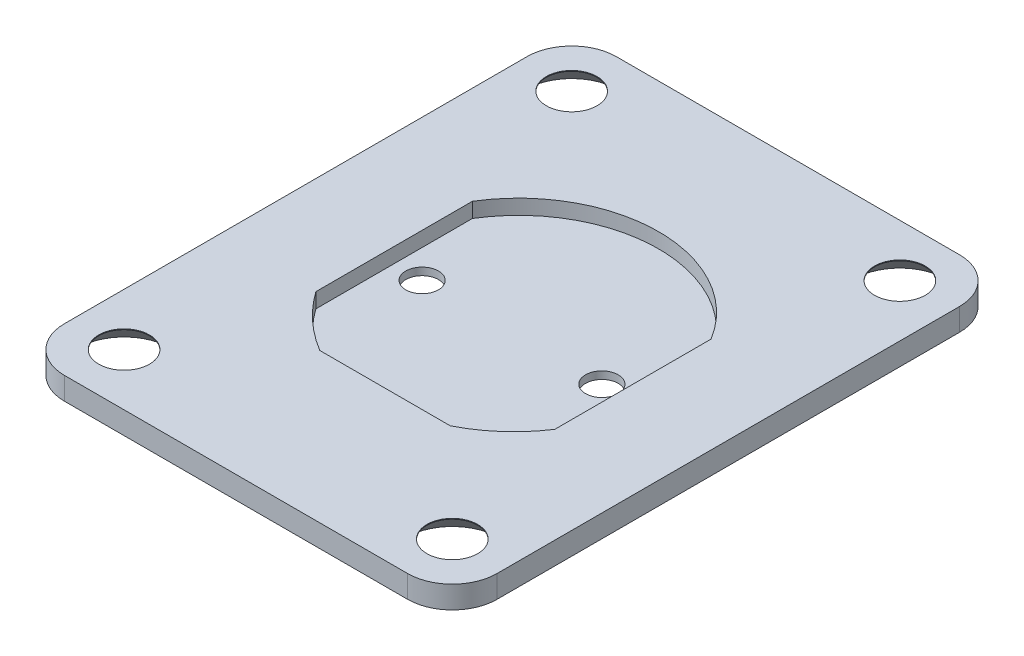
ISO-10303-21;
HEADER;
FILE_DESCRIPTION(('STEP AP214'),'2;1');
FILE_NAME('part.step','',(''),(''),'','','');
FILE_SCHEMA(('AUTOMOTIVE_DESIGN { 1 0 10303 214 1 1 1 1 }'));
ENDSEC;
DATA;
#1=APPLICATION_CONTEXT('core data for automotive mechanical design processes');
#2=APPLICATION_PROTOCOL_DEFINITION('international standard','automotive_design',2000,#1);
#3=PRODUCT_CONTEXT('',#1,'mechanical');
#4=PRODUCT('Part','Part','',(#3));
#5=PRODUCT_RELATED_PRODUCT_CATEGORY('part','',(#4));
#6=PRODUCT_DEFINITION_FORMATION('','',#4);
#7=PRODUCT_DEFINITION_CONTEXT('part definition',#1,'design');
#8=PRODUCT_DEFINITION('design','',#6,#7);
#9=PRODUCT_DEFINITION_SHAPE('','',#8);
#10=(LENGTH_UNIT() NAMED_UNIT(*) SI_UNIT(.MILLI.,.METRE.));
#11=(NAMED_UNIT(*) PLANE_ANGLE_UNIT() SI_UNIT($,.RADIAN.));
#12=(NAMED_UNIT(*) SI_UNIT($,.STERADIAN.) SOLID_ANGLE_UNIT());
#13=UNCERTAINTY_MEASURE_WITH_UNIT(LENGTH_MEASURE(1.E-05),#10,'distance_accuracy_value','');
#14=(GEOMETRIC_REPRESENTATION_CONTEXT(3) GLOBAL_UNCERTAINTY_ASSIGNED_CONTEXT((#13)) GLOBAL_UNIT_ASSIGNED_CONTEXT((#10,
#11,#12)) REPRESENTATION_CONTEXT('',''));
#15=CARTESIAN_POINT('',(0.,0.,0.));
#16=DIRECTION('',(0.,0.,1.));
#17=DIRECTION('',(1.,0.,0.));
#18=AXIS2_PLACEMENT_3D('',#15,#16,#17);
#19=CARTESIAN_POINT('',(0.,0.,0.));
#20=DIRECTION('',(0.,1.,0.));
#21=DIRECTION('',(0.,0.,1.));
#22=AXIS2_PLACEMENT_3D('',#19,#20,#21);
#23=PLANE('',#22);
#24=CARTESIAN_POINT('',(-11.,0.,15.));
#25=DIRECTION('',(0.,-1.,0.));
#26=DIRECTION('',(0.,0.,-1.));
#27=AXIS2_PLACEMENT_3D('',#24,#25,#26);
#28=CIRCLE('',#27,3.15);
#29=CARTESIAN_POINT('',(-11.,0.,11.85));
#30=VERTEX_POINT('',#29);
#31=EDGE_CURVE('E635',#30,#30,#28,.T.);
#32=ORIENTED_EDGE('',*,*,#31,.F.);
#33=EDGE_LOOP('',(#32));
#34=FACE_BOUND('',#33,.T.);
#35=CARTESIAN_POINT('',(-6.025,0.,0.));
#36=DIRECTION('',(0.,1.,0.));
#37=DIRECTION('',(0.,0.,1.));
#38=AXIS2_PLACEMENT_3D('',#35,#36,#37);
#39=CIRCLE('',#38,1.095);
#40=CARTESIAN_POINT('',(-6.025,0.,1.095));
#41=VERTEX_POINT('',#40);
#42=EDGE_CURVE('E238',#41,#41,#39,.T.);
#43=ORIENTED_EDGE('',*,*,#42,.T.);
#44=EDGE_LOOP('',(#43));
#45=FACE_BOUND('',#44,.T.);
#46=CARTESIAN_POINT('',(6.025,0.,0.));
#47=DIRECTION('',(0.,1.,0.));
#48=DIRECTION('',(0.,0.,1.));
#49=AXIS2_PLACEMENT_3D('',#46,#47,#48);
#50=CIRCLE('',#49,1.095);
#51=CARTESIAN_POINT('',(6.025,0.,1.095));
#52=VERTEX_POINT('',#51);
#53=EDGE_CURVE('E156',#52,#52,#50,.T.);
#54=ORIENTED_EDGE('',*,*,#53,.T.);
#55=EDGE_LOOP('',(#54));
#56=FACE_BOUND('',#55,.T.);
#57=DIRECTION('',(0.,0.,1.));
#58=VECTOR('',#57,1.);
#59=CARTESIAN_POINT('',(-14.5,0.,18.5));
#60=LINE('',#59,#58);
#61=CARTESIAN_POINT('',(-14.5,0.,-15.5));
#62=VERTEX_POINT('',#61);
#63=CARTESIAN_POINT('',(-14.5,0.,15.5));
#64=VERTEX_POINT('',#63);
#65=EDGE_CURVE('E253',#62,#64,#60,.T.);
#66=ORIENTED_EDGE('',*,*,#65,.F.);
#67=CARTESIAN_POINT('',(-11.5,0.,-15.5));
#68=DIRECTION('',(0.,1.,0.));
#69=DIRECTION('',(0.,0.,1.));
#70=AXIS2_PLACEMENT_3D('',#67,#68,#69);
#71=CIRCLE('',#70,3.);
#72=CARTESIAN_POINT('',(-11.5,0.,-18.5));
#73=VERTEX_POINT('',#72);
#74=EDGE_CURVE('E284',#62,#73,#71,.F.);
#75=ORIENTED_EDGE('',*,*,#74,.T.);
#76=DIRECTION('',(-1.,0.,0.));
#77=VECTOR('',#76,1.);
#78=CARTESIAN_POINT('',(14.5,0.,-18.5));
#79=LINE('',#78,#77);
#80=CARTESIAN_POINT('',(11.5,0.,-18.5));
#81=VERTEX_POINT('',#80);
#82=EDGE_CURVE('E264',#81,#73,#79,.T.);
#83=ORIENTED_EDGE('',*,*,#82,.F.);
#84=CARTESIAN_POINT('',(11.5,0.,-15.5));
#85=DIRECTION('',(0.,1.,0.));
#86=DIRECTION('',(0.,0.,1.));
#87=AXIS2_PLACEMENT_3D('',#84,#85,#86);
#88=CIRCLE('',#87,3.);
#89=CARTESIAN_POINT('',(14.5,0.,-15.5));
#90=VERTEX_POINT('',#89);
#91=EDGE_CURVE('E281',#81,#90,#88,.F.);
#92=ORIENTED_EDGE('',*,*,#91,.T.);
#93=DIRECTION('',(0.,0.,-1.));
#94=VECTOR('',#93,1.);
#95=CARTESIAN_POINT('',(14.5,0.,18.5));
#96=LINE('',#95,#94);
#97=CARTESIAN_POINT('',(14.5,0.,15.5));
#98=VERTEX_POINT('',#97);
#99=EDGE_CURVE('E261',#98,#90,#96,.T.);
#100=ORIENTED_EDGE('',*,*,#99,.F.);
#101=CARTESIAN_POINT('',(11.5,0.,15.5));
#102=DIRECTION('',(0.,1.,0.));
#103=DIRECTION('',(0.,0.,1.));
#104=AXIS2_PLACEMENT_3D('',#101,#102,#103);
#105=CIRCLE('',#104,3.);
#106=CARTESIAN_POINT('',(11.5,0.,18.5));
#107=VERTEX_POINT('',#106);
#108=EDGE_CURVE('E275',#98,#107,#105,.F.);
#109=ORIENTED_EDGE('',*,*,#108,.T.);
#110=DIRECTION('',(1.,0.,0.));
#111=VECTOR('',#110,1.);
#112=CARTESIAN_POINT('',(14.5,0.,18.5));
#113=LINE('',#112,#111);
#114=CARTESIAN_POINT('',(-11.5,0.,18.5));
#115=VERTEX_POINT('',#114);
#116=EDGE_CURVE('E257',#115,#107,#113,.T.);
#117=ORIENTED_EDGE('',*,*,#116,.F.);
#118=CARTESIAN_POINT('',(-11.5,0.,15.5));
#119=DIRECTION('',(0.,1.,0.));
#120=DIRECTION('',(0.,0.,1.));
#121=AXIS2_PLACEMENT_3D('',#118,#119,#120);
#122=CIRCLE('',#121,3.);
#123=EDGE_CURVE('E278',#115,#64,#122,.F.);
#124=ORIENTED_EDGE('',*,*,#123,.T.);
#125=EDGE_LOOP('',(#66,#75,#83,#92,#100,#109,#117,#124));
#126=FACE_BOUND('',#125,.T.);
#127=CARTESIAN_POINT('',(11.,0.,15.));
#128=DIRECTION('',(0.,-1.,0.));
#129=DIRECTION('',(0.,0.,-1.));
#130=AXIS2_PLACEMENT_3D('',#127,#128,#129);
#131=CIRCLE('',#130,3.15);
#132=CARTESIAN_POINT('',(11.,0.,11.85));
#133=VERTEX_POINT('',#132);
#134=EDGE_CURVE('E623',#133,#133,#131,.T.);
#135=ORIENTED_EDGE('',*,*,#134,.F.);
#136=EDGE_LOOP('',(#135));
#137=FACE_BOUND('',#136,.T.);
#138=CARTESIAN_POINT('',(11.,0.,-15.));
#139=DIRECTION('',(0.,-1.,0.));
#140=DIRECTION('',(0.,0.,-1.));
#141=AXIS2_PLACEMENT_3D('',#138,#139,#140);
#142=CIRCLE('',#141,3.15);
#143=CARTESIAN_POINT('',(11.,0.,-18.15));
#144=VERTEX_POINT('',#143);
#145=EDGE_CURVE('E611',#144,#144,#142,.T.);
#146=ORIENTED_EDGE('',*,*,#145,.F.);
#147=EDGE_LOOP('',(#146));
#148=FACE_BOUND('',#147,.T.);
#149=CARTESIAN_POINT('',(-11.,0.,-15.));
#150=DIRECTION('',(0.,-1.,0.));
#151=DIRECTION('',(0.,0.,-1.));
#152=AXIS2_PLACEMENT_3D('',#149,#150,#151);
#153=CIRCLE('',#152,3.15);
#154=CARTESIAN_POINT('',(-11.,0.,-18.15));
#155=VERTEX_POINT('',#154);
#156=EDGE_CURVE('E600',#155,#155,#153,.T.);
#157=ORIENTED_EDGE('',*,*,#156,.F.);
#158=EDGE_LOOP('',(#157));
#159=FACE_BOUND('',#158,.T.);
#160=ADVANCED_FACE('F40',(#34,#45,#56,#126,#137,#148,#159),#23,.F.);
#161=CARTESIAN_POINT('',(0.,0.5,0.));
#162=DIRECTION('',(0.,1.,0.));
#163=DIRECTION('',(0.,0.,1.));
#164=AXIS2_PLACEMENT_3D('',#161,#162,#163);
#165=PLANE('',#164);
#166=CARTESIAN_POINT('',(6.025,0.5,0.));
#167=DIRECTION('',(0.,1.,0.));
#168=DIRECTION('',(0.,0.,1.));
#169=AXIS2_PLACEMENT_3D('',#166,#167,#168);
#170=CIRCLE('',#169,1.095);
#171=CARTESIAN_POINT('',(6.025,0.5,1.095));
#172=VERTEX_POINT('',#171);
#173=EDGE_CURVE('E242',#172,#172,#170,.T.);
#174=ORIENTED_EDGE('',*,*,#173,.F.);
#175=EDGE_LOOP('',(#174));
#176=FACE_BOUND('',#175,.T.);
#177=CARTESIAN_POINT('',(-6.025,0.5,0.));
#178=DIRECTION('',(0.,1.,0.));
#179=DIRECTION('',(0.,0.,1.));
#180=AXIS2_PLACEMENT_3D('',#177,#178,#179);
#181=CIRCLE('',#180,1.095);
#182=CARTESIAN_POINT('',(-6.025,0.5,1.095));
#183=VERTEX_POINT('',#182);
#184=EDGE_CURVE('E249',#183,#183,#181,.T.);
#185=ORIENTED_EDGE('',*,*,#184,.F.);
#186=EDGE_LOOP('',(#185));
#187=FACE_BOUND('',#186,.T.);
#188=DIRECTION('',(-1.,0.,0.));
#189=VECTOR('',#188,1.);
#190=CARTESIAN_POINT('',(0.,0.5,8.49646857911351));
#191=LINE('',#190,#189);
#192=CARTESIAN_POINT('',(4.36293573535211,0.5,8.49646857911351));
#193=VERTEX_POINT('',#192);
#194=CARTESIAN_POINT('',(-4.38535437381607,0.5,8.49646857911351));
#195=VERTEX_POINT('',#194);
#196=EDGE_CURVE('E209',#193,#195,#191,.T.);
#197=ORIENTED_EDGE('',*,*,#196,.F.);
#198=CARTESIAN_POINT('',(0.0516392629655443,0.5,-0.0770388782704128));
#199=DIRECTION('',(0.,1.,0.));
#200=DIRECTION('',(0.,0.,1.));
#201=AXIS2_PLACEMENT_3D('',#198,#199,#200);
#202=CIRCLE('',#201,9.5964736958234);
#203=CARTESIAN_POINT('',(8.06575283771195,0.5,5.20181431212008));
#204=VERTEX_POINT('',#203);
#205=EDGE_CURVE('E152',#193,#204,#202,.T.);
#206=ORIENTED_EDGE('',*,*,#205,.T.);
#207=DIRECTION('',(0.,0.,-1.));
#208=VECTOR('',#207,1.);
#209=CARTESIAN_POINT('',(8.06575283771195,0.5,0.));
#210=LINE('',#209,#208);
#211=CARTESIAN_POINT('',(8.06575283771195,0.5,-5.28085689571229));
#212=VERTEX_POINT('',#211);
#213=EDGE_CURVE('E173',#204,#212,#210,.T.);
#214=ORIENTED_EDGE('',*,*,#213,.T.);
#215=CARTESIAN_POINT('',(0.065752837711952,0.5,-0.373244663344949));
#216=DIRECTION('',(0.,1.,0.));
#217=DIRECTION('',(0.,0.,1.));
#218=AXIS2_PLACEMENT_3D('',#215,#216,#217);
#219=CIRCLE('',#218,9.38534271208471);
#220=CARTESIAN_POINT('',(-7.93424716228805,0.5,-5.28085689571229));
#221=VERTEX_POINT('',#220);
#222=EDGE_CURVE('E176',#221,#212,#219,.F.);
#223=ORIENTED_EDGE('',*,*,#222,.F.);
#224=DIRECTION('',(0.,0.,-1.));
#225=VECTOR('',#224,1.);
#226=CARTESIAN_POINT('',(-7.93424716228805,0.5,0.));
#227=LINE('',#226,#225);
#228=CARTESIAN_POINT('',(-7.93424716228805,0.5,5.21151209766785));
#229=VERTEX_POINT('',#228);
#230=EDGE_CURVE('E215',#229,#221,#227,.T.);
#231=ORIENTED_EDGE('',*,*,#230,.F.);
#232=CARTESIAN_POINT('',(1.73650070340641,0.5,-1.67675504771776));
#233=DIRECTION('',(0.,1.,0.));
#234=DIRECTION('',(0.,0.,1.));
#235=AXIS2_PLACEMENT_3D('',#232,#233,#234);
#236=CIRCLE('',#235,11.8731456888237);
#237=EDGE_CURVE('E212',#229,#195,#236,.T.);
#238=ORIENTED_EDGE('',*,*,#237,.T.);
#239=EDGE_LOOP('',(#197,#206,#214,#223,#231,#238));
#240=FACE_BOUND('',#239,.T.);
#241=ADVANCED_FACE('F352',(#176,#187,#240),#165,.T.);
#242=CARTESIAN_POINT('',(-14.5,0.5,18.5));
#243=DIRECTION('',(1.,0.,0.));
#244=DIRECTION('',(0.,0.,-1.));
#245=AXIS2_PLACEMENT_3D('',#242,#243,#244);
#246=PLANE('',#245);
#247=DIRECTION('',(0.,0.,1.));
#248=VECTOR('',#247,1.);
#249=CARTESIAN_POINT('',(-14.5,1.5,0.));
#250=LINE('',#249,#248);
#251=CARTESIAN_POINT('',(-14.5,1.5,-15.5));
#252=VERTEX_POINT('',#251);
#253=CARTESIAN_POINT('',(-14.5,1.5,15.5));
#254=VERTEX_POINT('',#253);
#255=EDGE_CURVE('E196',#252,#254,#250,.T.);
#256=ORIENTED_EDGE('',*,*,#255,.F.);
#257=DIRECTION('',(0.,-1.,0.));
#258=VECTOR('',#257,1.);
#259=CARTESIAN_POINT('',(-14.5,0.5,-15.5));
#260=LINE('',#259,#258);
#261=EDGE_CURVE('E271',#252,#62,#260,.T.);
#262=ORIENTED_EDGE('',*,*,#261,.T.);
#263=ORIENTED_EDGE('',*,*,#65,.T.);
#264=DIRECTION('',(0.,-1.,0.));
#265=VECTOR('',#264,1.);
#266=CARTESIAN_POINT('',(-14.5,0.5,15.5));
#267=LINE('',#266,#265);
#268=EDGE_CURVE('E268',#64,#254,#267,.F.);
#269=ORIENTED_EDGE('',*,*,#268,.T.);
#270=EDGE_LOOP('',(#256,#262,#263,#269));
#271=FACE_BOUND('',#270,.T.);
#272=ADVANCED_FACE('F340',(#271),#246,.F.);
#273=CARTESIAN_POINT('',(14.5,0.5,18.5));
#274=DIRECTION('',(0.,0.,-1.));
#275=DIRECTION('',(-1.,0.,0.));
#276=AXIS2_PLACEMENT_3D('',#273,#274,#275);
#277=PLANE('',#276);
#278=DIRECTION('',(1.,0.,0.));
#279=VECTOR('',#278,1.);
#280=CARTESIAN_POINT('',(0.,1.5,18.5));
#281=LINE('',#280,#279);
#282=CARTESIAN_POINT('',(-11.5,1.5,18.5));
#283=VERTEX_POINT('',#282);
#284=CARTESIAN_POINT('',(11.5,1.5,18.5));
#285=VERTEX_POINT('',#284);
#286=EDGE_CURVE('E200',#283,#285,#281,.T.);
#287=ORIENTED_EDGE('',*,*,#286,.F.);
#288=DIRECTION('',(0.,-1.,0.));
#289=VECTOR('',#288,1.);
#290=CARTESIAN_POINT('',(-11.5,0.5,18.5));
#291=LINE('',#290,#289);
#292=EDGE_CURVE('E11',#283,#115,#291,.T.);
#293=ORIENTED_EDGE('',*,*,#292,.T.);
#294=ORIENTED_EDGE('',*,*,#116,.T.);
#295=DIRECTION('',(0.,-1.,0.));
#296=VECTOR('',#295,1.);
#297=CARTESIAN_POINT('',(11.5,0.5,18.5));
#298=LINE('',#297,#296);
#299=EDGE_CURVE('E49',#107,#285,#298,.F.);
#300=ORIENTED_EDGE('',*,*,#299,.T.);
#301=EDGE_LOOP('',(#287,#293,#294,#300));
#302=FACE_BOUND('',#301,.T.);
#303=ADVANCED_FACE('F314',(#302),#277,.F.);
#304=CARTESIAN_POINT('',(14.5,0.5,18.5));
#305=DIRECTION('',(-1.,0.,0.));
#306=DIRECTION('',(0.,0.,1.));
#307=AXIS2_PLACEMENT_3D('',#304,#305,#306);
#308=PLANE('',#307);
#309=ORIENTED_EDGE('',*,*,#99,.T.);
#310=DIRECTION('',(0.,-1.,0.));
#311=VECTOR('',#310,1.);
#312=CARTESIAN_POINT('',(14.5,0.5,-15.5));
#313=LINE('',#312,#311);
#314=CARTESIAN_POINT('',(14.5,1.5,-15.5));
#315=VERTEX_POINT('',#314);
#316=EDGE_CURVE('E56',#90,#315,#313,.F.);
#317=ORIENTED_EDGE('',*,*,#316,.T.);
#318=DIRECTION('',(0.,0.,-1.));
#319=VECTOR('',#318,1.);
#320=CARTESIAN_POINT('',(14.5,1.5,0.));
#321=LINE('',#320,#319);
#322=CARTESIAN_POINT('',(14.5,1.5,15.5));
#323=VERTEX_POINT('',#322);
#324=EDGE_CURVE('E203',#323,#315,#321,.T.);
#325=ORIENTED_EDGE('',*,*,#324,.F.);
#326=DIRECTION('',(0.,-1.,0.));
#327=VECTOR('',#326,1.);
#328=CARTESIAN_POINT('',(14.5,0.5,15.5));
#329=LINE('',#328,#327);
#330=EDGE_CURVE('E305',#323,#98,#329,.T.);
#331=ORIENTED_EDGE('',*,*,#330,.T.);
#332=EDGE_LOOP('',(#309,#317,#325,#331));
#333=FACE_BOUND('',#332,.T.);
#334=ADVANCED_FACE('F321',(#333),#308,.F.);
#335=CARTESIAN_POINT('',(14.5,0.5,-18.5));
#336=DIRECTION('',(0.,0.,1.));
#337=DIRECTION('',(1.,0.,0.));
#338=AXIS2_PLACEMENT_3D('',#335,#336,#337);
#339=PLANE('',#338);
#340=ORIENTED_EDGE('',*,*,#82,.T.);
#341=DIRECTION('',(0.,-1.,0.));
#342=VECTOR('',#341,1.);
#343=CARTESIAN_POINT('',(-11.5,0.5,-18.5));
#344=LINE('',#343,#342);
#345=CARTESIAN_POINT('',(-11.5,1.5,-18.5));
#346=VERTEX_POINT('',#345);
#347=EDGE_CURVE('E291',#73,#346,#344,.F.);
#348=ORIENTED_EDGE('',*,*,#347,.T.);
#349=DIRECTION('',(-1.,0.,0.));
#350=VECTOR('',#349,1.);
#351=CARTESIAN_POINT('',(0.,1.5,-18.5));
#352=LINE('',#351,#350);
#353=CARTESIAN_POINT('',(11.5,1.5,-18.5));
#354=VERTEX_POINT('',#353);
#355=EDGE_CURVE('E192',#354,#346,#352,.T.);
#356=ORIENTED_EDGE('',*,*,#355,.F.);
#357=DIRECTION('',(0.,-1.,0.));
#358=VECTOR('',#357,1.);
#359=CARTESIAN_POINT('',(11.5,0.5,-18.5));
#360=LINE('',#359,#358);
#361=EDGE_CURVE('E287',#354,#81,#360,.T.);
#362=ORIENTED_EDGE('',*,*,#361,.T.);
#363=EDGE_LOOP('',(#340,#348,#356,#362));
#364=FACE_BOUND('',#363,.T.);
#365=ADVANCED_FACE('F332',(#364),#339,.F.);
#366=CARTESIAN_POINT('',(6.025,0.,0.));
#367=DIRECTION('',(0.,1.,0.));
#368=DIRECTION('',(0.,0.,1.));
#369=AXIS2_PLACEMENT_3D('',#366,#367,#368);
#370=CYLINDRICAL_SURFACE('',#369,1.095);
#371=ORIENTED_EDGE('',*,*,#173,.T.);
#372=EDGE_LOOP('',(#371));
#373=FACE_BOUND('',#372,.T.);
#374=ORIENTED_EDGE('',*,*,#53,.F.);
#375=EDGE_LOOP('',(#374));
#376=FACE_BOUND('',#375,.T.);
#377=ADVANCED_FACE('F366',(#373,#376),#370,.F.);
#378=CARTESIAN_POINT('',(-6.025,0.,0.));
#379=DIRECTION('',(0.,1.,0.));
#380=DIRECTION('',(0.,0.,1.));
#381=AXIS2_PLACEMENT_3D('',#378,#379,#380);
#382=CYLINDRICAL_SURFACE('',#381,1.095);
#383=ORIENTED_EDGE('',*,*,#184,.T.);
#384=EDGE_LOOP('',(#383));
#385=FACE_BOUND('',#384,.T.);
#386=ORIENTED_EDGE('',*,*,#42,.F.);
#387=EDGE_LOOP('',(#386));
#388=FACE_BOUND('',#387,.T.);
#389=ADVANCED_FACE('F406',(#385,#388),#382,.F.);
#390=CARTESIAN_POINT('',(0.0516392629655443,1.5,-0.0770388782704128));
#391=DIRECTION('',(0.,-1.,0.));
#392=DIRECTION('',(0.,0.,-1.));
#393=AXIS2_PLACEMENT_3D('',#390,#391,#392);
#394=CYLINDRICAL_SURFACE('',#393,9.5964736958234);
#395=ORIENTED_EDGE('',*,*,#205,.F.);
#396=DIRECTION('',(0.,-1.,0.));
#397=VECTOR('',#396,1.);
#398=CARTESIAN_POINT('',(4.36293573535211,1.5,8.49646857911351));
#399=LINE('',#398,#397);
#400=CARTESIAN_POINT('',(4.36293573535211,1.5,8.49646857911351));
#401=VERTEX_POINT('',#400);
#402=EDGE_CURVE('E145',#401,#193,#399,.T.);
#403=ORIENTED_EDGE('',*,*,#402,.F.);
#404=CARTESIAN_POINT('',(0.0516392629655443,1.5,-0.0770388782704128));
#405=DIRECTION('',(0.,1.,0.));
#406=DIRECTION('',(0.,0.,1.));
#407=AXIS2_PLACEMENT_3D('',#404,#405,#406);
#408=CIRCLE('',#407,9.5964736958234);
#409=CARTESIAN_POINT('',(8.06575283771195,1.5,5.20181431212008));
#410=VERTEX_POINT('',#409);
#411=EDGE_CURVE('E150',#401,#410,#408,.T.);
#412=ORIENTED_EDGE('',*,*,#411,.T.);
#413=DIRECTION('',(0.,-1.,0.));
#414=VECTOR('',#413,1.);
#415=CARTESIAN_POINT('',(8.06575283771195,1.5,5.20181431212008));
#416=LINE('',#415,#414);
#417=EDGE_CURVE('E206',#410,#204,#416,.T.);
#418=ORIENTED_EDGE('',*,*,#417,.T.);
#419=EDGE_LOOP('',(#395,#403,#412,#418));
#420=FACE_BOUND('',#419,.T.);
#421=ADVANCED_FACE('F147',(#420),#394,.F.);
#422=CARTESIAN_POINT('',(0.,1.5,8.49646857911351));
#423=DIRECTION('',(0.,0.,1.));
#424=DIRECTION('',(1.,0.,0.));
#425=AXIS2_PLACEMENT_3D('',#422,#423,#424);
#426=PLANE('',#425);
#427=ORIENTED_EDGE('',*,*,#196,.T.);
#428=DIRECTION('',(0.,-1.,0.));
#429=VECTOR('',#428,1.);
#430=CARTESIAN_POINT('',(-4.38535437381607,1.5,8.49646857911351));
#431=LINE('',#430,#429);
#432=CARTESIAN_POINT('',(-4.38535437381607,1.5,8.49646857911351));
#433=VERTEX_POINT('',#432);
#434=EDGE_CURVE('E157',#433,#195,#431,.T.);
#435=ORIENTED_EDGE('',*,*,#434,.F.);
#436=DIRECTION('',(-1.,0.,0.));
#437=VECTOR('',#436,1.);
#438=CARTESIAN_POINT('',(0.,1.5,8.49646857911351));
#439=LINE('',#438,#437);
#440=EDGE_CURVE('E160',#401,#433,#439,.T.);
#441=ORIENTED_EDGE('',*,*,#440,.F.);
#442=ORIENTED_EDGE('',*,*,#402,.T.);
#443=EDGE_LOOP('',(#427,#435,#441,#442));
#444=FACE_BOUND('',#443,.T.);
#445=ADVANCED_FACE('F161',(#444),#426,.F.);
#446=CARTESIAN_POINT('',(1.73650070340641,1.5,-1.67675504771776));
#447=DIRECTION('',(0.,-1.,0.));
#448=DIRECTION('',(0.,0.,-1.));
#449=AXIS2_PLACEMENT_3D('',#446,#447,#448);
#450=CYLINDRICAL_SURFACE('',#449,11.8731456888237);
#451=ORIENTED_EDGE('',*,*,#237,.F.);
#452=DIRECTION('',(0.,-1.,0.));
#453=VECTOR('',#452,1.);
#454=CARTESIAN_POINT('',(-7.93424716228805,1.5,5.21151209766785));
#455=LINE('',#454,#453);
#456=CARTESIAN_POINT('',(-7.93424716228805,1.5,5.21151209766785));
#457=VERTEX_POINT('',#456);
#458=EDGE_CURVE('E232',#457,#229,#455,.T.);
#459=ORIENTED_EDGE('',*,*,#458,.F.);
#460=CARTESIAN_POINT('',(1.73650070340641,1.5,-1.67675504771776));
#461=DIRECTION('',(0.,1.,0.));
#462=DIRECTION('',(0.,0.,1.));
#463=AXIS2_PLACEMENT_3D('',#460,#461,#462);
#464=CIRCLE('',#463,11.8731456888237);
#465=EDGE_CURVE('E167',#457,#433,#464,.T.);
#466=ORIENTED_EDGE('',*,*,#465,.T.);
#467=ORIENTED_EDGE('',*,*,#434,.T.);
#468=EDGE_LOOP('',(#451,#459,#466,#467));
#469=FACE_BOUND('',#468,.T.);
#470=ADVANCED_FACE('F397',(#469),#450,.F.);
#471=CARTESIAN_POINT('',(-7.93424716228805,1.5,0.));
#472=DIRECTION('',(-1.,0.,0.));
#473=DIRECTION('',(0.,0.,1.));
#474=AXIS2_PLACEMENT_3D('',#471,#472,#473);
#475=PLANE('',#474);
#476=ORIENTED_EDGE('',*,*,#230,.T.);
#477=DIRECTION('',(0.,-1.,0.));
#478=VECTOR('',#477,1.);
#479=CARTESIAN_POINT('',(-7.93424716228805,1.5,-5.28085689571229));
#480=LINE('',#479,#478);
#481=CARTESIAN_POINT('',(-7.93424716228805,1.5,-5.28085689571229));
#482=VERTEX_POINT('',#481);
#483=EDGE_CURVE('E228',#482,#221,#480,.T.);
#484=ORIENTED_EDGE('',*,*,#483,.F.);
#485=DIRECTION('',(0.,0.,-1.));
#486=VECTOR('',#485,1.);
#487=CARTESIAN_POINT('',(-7.93424716228805,1.5,0.));
#488=LINE('',#487,#486);
#489=EDGE_CURVE('E184',#457,#482,#488,.T.);
#490=ORIENTED_EDGE('',*,*,#489,.F.);
#491=ORIENTED_EDGE('',*,*,#458,.T.);
#492=EDGE_LOOP('',(#476,#484,#490,#491));
#493=FACE_BOUND('',#492,.T.);
#494=ADVANCED_FACE('F393',(#493),#475,.F.);
#495=CARTESIAN_POINT('',(0.065752837711952,1.5,-0.373244663344949));
#496=DIRECTION('',(0.,-1.,0.));
#497=DIRECTION('',(0.,0.,-1.));
#498=AXIS2_PLACEMENT_3D('',#495,#496,#497);
#499=CYLINDRICAL_SURFACE('',#498,9.38534271208471);
#500=ORIENTED_EDGE('',*,*,#222,.T.);
#501=DIRECTION('',(0.,-1.,0.));
#502=VECTOR('',#501,1.);
#503=CARTESIAN_POINT('',(8.06575283771195,1.5,-5.28085689571229));
#504=LINE('',#503,#502);
#505=CARTESIAN_POINT('',(8.06575283771195,1.5,-5.28085689571229));
#506=VERTEX_POINT('',#505);
#507=EDGE_CURVE('E224',#506,#212,#504,.T.);
#508=ORIENTED_EDGE('',*,*,#507,.F.);
#509=CARTESIAN_POINT('',(0.065752837711952,1.5,-0.373244663344949));
#510=DIRECTION('',(0.,1.,0.));
#511=DIRECTION('',(0.,0.,1.));
#512=AXIS2_PLACEMENT_3D('',#509,#510,#511);
#513=CIRCLE('',#512,9.38534271208471);
#514=EDGE_CURVE('E187',#482,#506,#513,.F.);
#515=ORIENTED_EDGE('',*,*,#514,.F.);
#516=ORIENTED_EDGE('',*,*,#483,.T.);
#517=EDGE_LOOP('',(#500,#508,#515,#516));
#518=FACE_BOUND('',#517,.T.);
#519=ADVANCED_FACE('F383',(#518),#499,.F.);
#520=CARTESIAN_POINT('',(8.06575283771195,1.5,0.));
#521=DIRECTION('',(-1.,0.,0.));
#522=DIRECTION('',(0.,0.,1.));
#523=AXIS2_PLACEMENT_3D('',#520,#521,#522);
#524=PLANE('',#523);
#525=ORIENTED_EDGE('',*,*,#213,.F.);
#526=ORIENTED_EDGE('',*,*,#417,.F.);
#527=DIRECTION('',(0.,0.,-1.));
#528=VECTOR('',#527,1.);
#529=CARTESIAN_POINT('',(8.06575283771195,1.5,0.));
#530=LINE('',#529,#528);
#531=EDGE_CURVE('E171',#410,#506,#530,.T.);
#532=ORIENTED_EDGE('',*,*,#531,.T.);
#533=ORIENTED_EDGE('',*,*,#507,.T.);
#534=EDGE_LOOP('',(#525,#526,#532,#533));
#535=FACE_BOUND('',#534,.T.);
#536=ADVANCED_FACE('F377',(#535),#524,.T.);
#537=CARTESIAN_POINT('',(0.,1.5,0.));
#538=DIRECTION('',(0.,1.,0.));
#539=DIRECTION('',(0.,0.,1.));
#540=AXIS2_PLACEMENT_3D('',#537,#538,#539);
#541=PLANE('',#540);
#542=CARTESIAN_POINT('',(-11.,1.5,-15.));
#543=DIRECTION('',(0.,1.,0.));
#544=DIRECTION('',(0.,0.,1.));
#545=AXIS2_PLACEMENT_3D('',#542,#543,#544);
#546=CIRCLE('',#545,1.69999999999999);
#547=CARTESIAN_POINT('',(-11.,1.5,-13.3));
#548=VERTEX_POINT('',#547);
#549=EDGE_CURVE('E605',#548,#548,#546,.T.);
#550=ORIENTED_EDGE('',*,*,#549,.F.);
#551=EDGE_LOOP('',(#550));
#552=FACE_BOUND('',#551,.T.);
#553=CARTESIAN_POINT('',(11.,1.5,-15.));
#554=DIRECTION('',(0.,1.,0.));
#555=DIRECTION('',(0.,0.,1.));
#556=AXIS2_PLACEMENT_3D('',#553,#554,#555);
#557=CIRCLE('',#556,1.69999999999999);
#558=CARTESIAN_POINT('',(11.,1.5,-13.3));
#559=VERTEX_POINT('',#558);
#560=EDGE_CURVE('E619',#559,#559,#557,.T.);
#561=ORIENTED_EDGE('',*,*,#560,.F.);
#562=EDGE_LOOP('',(#561));
#563=FACE_BOUND('',#562,.T.);
#564=CARTESIAN_POINT('',(11.,1.5,15.));
#565=DIRECTION('',(0.,1.,0.));
#566=DIRECTION('',(0.,0.,1.));
#567=AXIS2_PLACEMENT_3D('',#564,#565,#566);
#568=CIRCLE('',#567,1.69999999999999);
#569=CARTESIAN_POINT('',(11.,1.5,16.7));
#570=VERTEX_POINT('',#569);
#571=EDGE_CURVE('E631',#570,#570,#568,.T.);
#572=ORIENTED_EDGE('',*,*,#571,.F.);
#573=EDGE_LOOP('',(#572));
#574=FACE_BOUND('',#573,.T.);
#575=CARTESIAN_POINT('',(-11.,1.5,15.));
#576=DIRECTION('',(0.,1.,0.));
#577=DIRECTION('',(0.,0.,1.));
#578=AXIS2_PLACEMENT_3D('',#575,#576,#577);
#579=CIRCLE('',#578,1.69999999999999);
#580=CARTESIAN_POINT('',(-11.,1.5,16.7));
#581=VERTEX_POINT('',#580);
#582=EDGE_CURVE('E179',#581,#581,#579,.T.);
#583=ORIENTED_EDGE('',*,*,#582,.F.);
#584=EDGE_LOOP('',(#583));
#585=FACE_BOUND('',#584,.T.);
#586=ORIENTED_EDGE('',*,*,#411,.F.);
#587=ORIENTED_EDGE('',*,*,#440,.T.);
#588=ORIENTED_EDGE('',*,*,#465,.F.);
#589=ORIENTED_EDGE('',*,*,#489,.T.);
#590=ORIENTED_EDGE('',*,*,#514,.T.);
#591=ORIENTED_EDGE('',*,*,#531,.F.);
#592=EDGE_LOOP('',(#586,#587,#588,#589,#590,#591));
#593=FACE_BOUND('',#592,.T.);
#594=ORIENTED_EDGE('',*,*,#355,.T.);
#595=CARTESIAN_POINT('',(-11.5,1.5,-15.5));
#596=DIRECTION('',(0.,1.,0.));
#597=DIRECTION('',(0.,0.,1.));
#598=AXIS2_PLACEMENT_3D('',#595,#596,#597);
#599=CIRCLE('',#598,3.);
#600=EDGE_CURVE('E302',#346,#252,#599,.T.);
#601=ORIENTED_EDGE('',*,*,#600,.T.);
#602=ORIENTED_EDGE('',*,*,#255,.T.);
#603=CARTESIAN_POINT('',(-11.5,1.5,15.5));
#604=DIRECTION('',(0.,1.,0.));
#605=DIRECTION('',(0.,0.,1.));
#606=AXIS2_PLACEMENT_3D('',#603,#604,#605);
#607=CIRCLE('',#606,3.);
#608=EDGE_CURVE('E296',#254,#283,#607,.T.);
#609=ORIENTED_EDGE('',*,*,#608,.T.);
#610=ORIENTED_EDGE('',*,*,#286,.T.);
#611=CARTESIAN_POINT('',(11.5,1.5,15.5));
#612=DIRECTION('',(0.,1.,0.));
#613=DIRECTION('',(0.,0.,1.));
#614=AXIS2_PLACEMENT_3D('',#611,#612,#613);
#615=CIRCLE('',#614,3.);
#616=EDGE_CURVE('E63',#285,#323,#615,.T.);
#617=ORIENTED_EDGE('',*,*,#616,.T.);
#618=ORIENTED_EDGE('',*,*,#324,.T.);
#619=CARTESIAN_POINT('',(11.5,1.5,-15.5));
#620=DIRECTION('',(0.,1.,0.));
#621=DIRECTION('',(0.,0.,1.));
#622=AXIS2_PLACEMENT_3D('',#619,#620,#621);
#623=CIRCLE('',#622,3.);
#624=EDGE_CURVE('E299',#315,#354,#623,.T.);
#625=ORIENTED_EDGE('',*,*,#624,.T.);
#626=EDGE_LOOP('',(#594,#601,#602,#609,#610,#617,#618,#625));
#627=FACE_BOUND('',#626,.T.);
#628=ADVANCED_FACE('F169',(#552,#563,#574,#585,#593,#627),#541,.T.);
#629=CARTESIAN_POINT('',(-11.5,0.5,-15.5));
#630=DIRECTION('',(0.,-1.,0.));
#631=DIRECTION('',(0.,0.,-1.));
#632=AXIS2_PLACEMENT_3D('',#629,#630,#631);
#633=CYLINDRICAL_SURFACE('',#632,3.);
#634=ORIENTED_EDGE('',*,*,#600,.F.);
#635=ORIENTED_EDGE('',*,*,#347,.F.);
#636=ORIENTED_EDGE('',*,*,#74,.F.);
#637=ORIENTED_EDGE('',*,*,#261,.F.);
#638=EDGE_LOOP('',(#634,#635,#636,#637));
#639=FACE_BOUND('',#638,.T.);
#640=ADVANCED_FACE('F338',(#639),#633,.T.);
#641=CARTESIAN_POINT('',(11.5,0.5,-15.5));
#642=DIRECTION('',(0.,-1.,0.));
#643=DIRECTION('',(0.,0.,-1.));
#644=AXIS2_PLACEMENT_3D('',#641,#642,#643);
#645=CYLINDRICAL_SURFACE('',#644,3.);
#646=ORIENTED_EDGE('',*,*,#624,.F.);
#647=ORIENTED_EDGE('',*,*,#316,.F.);
#648=ORIENTED_EDGE('',*,*,#91,.F.);
#649=ORIENTED_EDGE('',*,*,#361,.F.);
#650=EDGE_LOOP('',(#646,#647,#648,#649));
#651=FACE_BOUND('',#650,.T.);
#652=ADVANCED_FACE('F329',(#651),#645,.T.);
#653=CARTESIAN_POINT('',(-11.5,0.5,15.5));
#654=DIRECTION('',(0.,-1.,0.));
#655=DIRECTION('',(0.,0.,-1.));
#656=AXIS2_PLACEMENT_3D('',#653,#654,#655);
#657=CYLINDRICAL_SURFACE('',#656,3.);
#658=ORIENTED_EDGE('',*,*,#608,.F.);
#659=ORIENTED_EDGE('',*,*,#268,.F.);
#660=ORIENTED_EDGE('',*,*,#123,.F.);
#661=ORIENTED_EDGE('',*,*,#292,.F.);
#662=EDGE_LOOP('',(#658,#659,#660,#661));
#663=FACE_BOUND('',#662,.T.);
#664=ADVANCED_FACE('F343',(#663),#657,.T.);
#665=CARTESIAN_POINT('',(11.5,0.5,15.5));
#666=DIRECTION('',(0.,-1.,0.));
#667=DIRECTION('',(0.,0.,-1.));
#668=AXIS2_PLACEMENT_3D('',#665,#666,#667);
#669=CYLINDRICAL_SURFACE('',#668,3.);
#670=ORIENTED_EDGE('',*,*,#616,.F.);
#671=ORIENTED_EDGE('',*,*,#299,.F.);
#672=ORIENTED_EDGE('',*,*,#108,.F.);
#673=ORIENTED_EDGE('',*,*,#330,.F.);
#674=EDGE_LOOP('',(#670,#671,#672,#673));
#675=FACE_BOUND('',#674,.T.);
#676=ADVANCED_FACE('F42',(#675),#669,.T.);
#677=CARTESIAN_POINT('',(-11.,0.,15.));
#678=DIRECTION('',(0.,-1.,0.));
#679=DIRECTION('',(0.,0.,-1.));
#680=AXIS2_PLACEMENT_3D('',#677,#678,#679);
#681=CYLINDRICAL_SURFACE('',#680,1.69999999999999);
#682=CARTESIAN_POINT('',(-11.,1.45000000000001,15.));
#683=DIRECTION('',(0.,-1.,0.));
#684=DIRECTION('',(0.,0.,-1.));
#685=AXIS2_PLACEMENT_3D('',#682,#683,#684);
#686=CIRCLE('',#685,1.69999999999999);
#687=CARTESIAN_POINT('',(-11.,1.45000000000001,13.3));
#688=VERTEX_POINT('',#687);
#689=EDGE_CURVE('E638',#688,#688,#686,.T.);
#690=ORIENTED_EDGE('',*,*,#689,.T.);
#691=EDGE_LOOP('',(#690));
#692=FACE_BOUND('',#691,.T.);
#693=ORIENTED_EDGE('',*,*,#582,.T.);
#694=EDGE_LOOP('',(#693));
#695=FACE_BOUND('',#694,.T.);
#696=ADVANCED_FACE('F349',(#692,#695),#681,.F.);
#697=CARTESIAN_POINT('',(-11.,0.,15.));
#698=DIRECTION('',(0.,-1.,0.));
#699=DIRECTION('',(0.,0.,-1.));
#700=AXIS2_PLACEMENT_3D('',#697,#698,#699);
#701=CONICAL_SURFACE('',#700,3.15,0.78539816339745);
#702=ORIENTED_EDGE('',*,*,#689,.F.);
#703=EDGE_LOOP('',(#702));
#704=FACE_BOUND('',#703,.T.);
#705=ORIENTED_EDGE('',*,*,#31,.T.);
#706=EDGE_LOOP('',(#705));
#707=FACE_BOUND('',#706,.T.);
#708=ADVANCED_FACE('F522',(#704,#707),#701,.F.);
#709=CARTESIAN_POINT('',(11.,0.,15.));
#710=DIRECTION('',(0.,-1.,0.));
#711=DIRECTION('',(0.,0.,-1.));
#712=AXIS2_PLACEMENT_3D('',#709,#710,#711);
#713=CYLINDRICAL_SURFACE('',#712,1.69999999999999);
#714=CARTESIAN_POINT('',(11.,1.45000000000001,15.));
#715=DIRECTION('',(0.,-1.,0.));
#716=DIRECTION('',(0.,0.,-1.));
#717=AXIS2_PLACEMENT_3D('',#714,#715,#716);
#718=CIRCLE('',#717,1.69999999999999);
#719=CARTESIAN_POINT('',(11.,1.45000000000001,13.3));
#720=VERTEX_POINT('',#719);
#721=EDGE_CURVE('E627',#720,#720,#718,.T.);
#722=ORIENTED_EDGE('',*,*,#721,.T.);
#723=EDGE_LOOP('',(#722));
#724=FACE_BOUND('',#723,.T.);
#725=ORIENTED_EDGE('',*,*,#571,.T.);
#726=EDGE_LOOP('',(#725));
#727=FACE_BOUND('',#726,.T.);
#728=ADVANCED_FACE('F531',(#724,#727),#713,.F.);
#729=CARTESIAN_POINT('',(11.,0.,15.));
#730=DIRECTION('',(0.,-1.,0.));
#731=DIRECTION('',(0.,0.,-1.));
#732=AXIS2_PLACEMENT_3D('',#729,#730,#731);
#733=CONICAL_SURFACE('',#732,3.15,0.78539816339745);
#734=ORIENTED_EDGE('',*,*,#721,.F.);
#735=EDGE_LOOP('',(#734));
#736=FACE_BOUND('',#735,.T.);
#737=ORIENTED_EDGE('',*,*,#134,.T.);
#738=EDGE_LOOP('',(#737));
#739=FACE_BOUND('',#738,.T.);
#740=ADVANCED_FACE('F540',(#736,#739),#733,.F.);
#741=CARTESIAN_POINT('',(11.,0.,-15.));
#742=DIRECTION('',(0.,-1.,0.));
#743=DIRECTION('',(0.,0.,-1.));
#744=AXIS2_PLACEMENT_3D('',#741,#742,#743);
#745=CYLINDRICAL_SURFACE('',#744,1.69999999999999);
#746=CARTESIAN_POINT('',(11.,1.45000000000001,-15.));
#747=DIRECTION('',(0.,-1.,0.));
#748=DIRECTION('',(0.,0.,-1.));
#749=AXIS2_PLACEMENT_3D('',#746,#747,#748);
#750=CIRCLE('',#749,1.69999999999999);
#751=CARTESIAN_POINT('',(11.,1.45000000000001,-16.7));
#752=VERTEX_POINT('',#751);
#753=EDGE_CURVE('E615',#752,#752,#750,.T.);
#754=ORIENTED_EDGE('',*,*,#753,.T.);
#755=EDGE_LOOP('',(#754));
#756=FACE_BOUND('',#755,.T.);
#757=ORIENTED_EDGE('',*,*,#560,.T.);
#758=EDGE_LOOP('',(#757));
#759=FACE_BOUND('',#758,.T.);
#760=ADVANCED_FACE('F550',(#756,#759),#745,.F.);
#761=CARTESIAN_POINT('',(11.,0.,-15.));
#762=DIRECTION('',(0.,-1.,0.));
#763=DIRECTION('',(0.,0.,-1.));
#764=AXIS2_PLACEMENT_3D('',#761,#762,#763);
#765=CONICAL_SURFACE('',#764,3.15,0.78539816339745);
#766=ORIENTED_EDGE('',*,*,#753,.F.);
#767=EDGE_LOOP('',(#766));
#768=FACE_BOUND('',#767,.T.);
#769=ORIENTED_EDGE('',*,*,#145,.T.);
#770=EDGE_LOOP('',(#769));
#771=FACE_BOUND('',#770,.T.);
#772=ADVANCED_FACE('F560',(#768,#771),#765,.F.);
#773=CARTESIAN_POINT('',(-11.,0.,-15.));
#774=DIRECTION('',(0.,-1.,0.));
#775=DIRECTION('',(0.,0.,-1.));
#776=AXIS2_PLACEMENT_3D('',#773,#774,#775);
#777=CYLINDRICAL_SURFACE('',#776,1.69999999999999);
#778=CARTESIAN_POINT('',(-11.,1.45000000000001,-15.));
#779=DIRECTION('',(0.,-1.,0.));
#780=DIRECTION('',(0.,0.,-1.));
#781=AXIS2_PLACEMENT_3D('',#778,#779,#780);
#782=CIRCLE('',#781,1.69999999999999);
#783=CARTESIAN_POINT('',(-11.,1.45000000000001,-16.7));
#784=VERTEX_POINT('',#783);
#785=EDGE_CURVE('E597',#784,#784,#782,.T.);
#786=ORIENTED_EDGE('',*,*,#785,.T.);
#787=EDGE_LOOP('',(#786));
#788=FACE_BOUND('',#787,.T.);
#789=ORIENTED_EDGE('',*,*,#549,.T.);
#790=EDGE_LOOP('',(#789));
#791=FACE_BOUND('',#790,.T.);
#792=ADVANCED_FACE('F570',(#788,#791),#777,.F.);
#793=CARTESIAN_POINT('',(-11.,0.,-15.));
#794=DIRECTION('',(0.,-1.,0.));
#795=DIRECTION('',(0.,0.,-1.));
#796=AXIS2_PLACEMENT_3D('',#793,#794,#795);
#797=CONICAL_SURFACE('',#796,3.15,0.78539816339745);
#798=ORIENTED_EDGE('',*,*,#785,.F.);
#799=EDGE_LOOP('',(#798));
#800=FACE_BOUND('',#799,.T.);
#801=ORIENTED_EDGE('',*,*,#156,.T.);
#802=EDGE_LOOP('',(#801));
#803=FACE_BOUND('',#802,.T.);
#804=ADVANCED_FACE('F580',(#800,#803),#797,.F.);
#805=CLOSED_SHELL('',(#160,#241,#272,#303,#334,#365,#377,#389,#421,#445,#470,#494,#519,#536,
#628,#640,#652,#664,#676,#696,#708,#728,#740,#760,#772,#792,#804));
#806=MANIFOLD_SOLID_BREP('B2',#805);
#807=ADVANCED_BREP_SHAPE_REPRESENTATION('',(#18,#806),#14);
#808=SHAPE_DEFINITION_REPRESENTATION(#9,#807);
ENDSEC;
END-ISO-10303-21;
